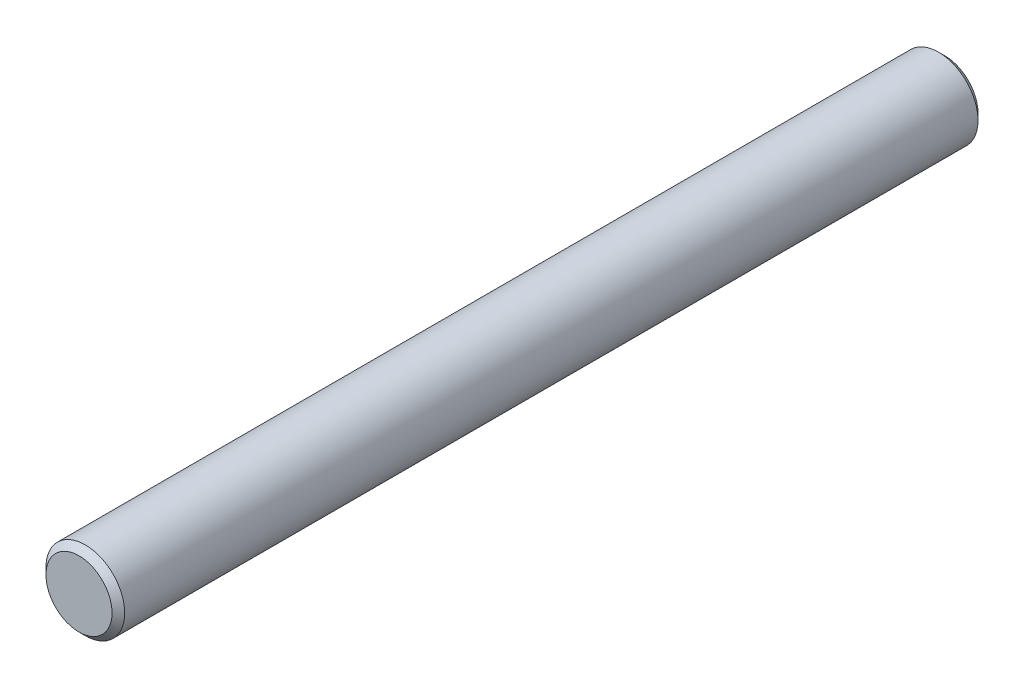
ISO-10303-21;
HEADER;
FILE_DESCRIPTION(('STEP AP214'),'2;1');
FILE_NAME('part.step','',(''),(''),'','','');
FILE_SCHEMA(('AUTOMOTIVE_DESIGN { 1 0 10303 214 1 1 1 1 }'));
ENDSEC;
DATA;
#1=APPLICATION_CONTEXT('core data for automotive mechanical design processes');
#2=APPLICATION_PROTOCOL_DEFINITION('international standard','automotive_design',2000,#1);
#3=PRODUCT_CONTEXT('',#1,'mechanical');
#4=PRODUCT('Part','Part','',(#3));
#5=PRODUCT_RELATED_PRODUCT_CATEGORY('part','',(#4));
#6=PRODUCT_DEFINITION_FORMATION('','',#4);
#7=PRODUCT_DEFINITION_CONTEXT('part definition',#1,'design');
#8=PRODUCT_DEFINITION('design','',#6,#7);
#9=PRODUCT_DEFINITION_SHAPE('','',#8);
#10=(LENGTH_UNIT() NAMED_UNIT(*) SI_UNIT(.MILLI.,.METRE.));
#11=(NAMED_UNIT(*) PLANE_ANGLE_UNIT() SI_UNIT($,.RADIAN.));
#12=(NAMED_UNIT(*) SI_UNIT($,.STERADIAN.) SOLID_ANGLE_UNIT());
#13=UNCERTAINTY_MEASURE_WITH_UNIT(LENGTH_MEASURE(1.E-05),#10,'distance_accuracy_value','');
#14=(GEOMETRIC_REPRESENTATION_CONTEXT(3) GLOBAL_UNCERTAINTY_ASSIGNED_CONTEXT((#13)) GLOBAL_UNIT_ASSIGNED_CONTEXT((#10,
#11,#12)) REPRESENTATION_CONTEXT('',''));
#15=CARTESIAN_POINT('',(0.,0.,0.));
#16=DIRECTION('',(0.,0.,1.));
#17=DIRECTION('',(1.,0.,0.));
#18=AXIS2_PLACEMENT_3D('',#15,#16,#17);
#19=CARTESIAN_POINT('',(0.,0.,13.75));
#20=DIRECTION('',(0.,0.,-1.));
#21=DIRECTION('',(-1.,0.,0.));
#22=AXIS2_PLACEMENT_3D('',#19,#20,#21);
#23=CYLINDRICAL_SURFACE('',#22,1.25);
#24=CARTESIAN_POINT('',(0.,0.,-13.55));
#25=DIRECTION('',(0.,0.,1.));
#26=DIRECTION('',(1.,0.,0.));
#27=AXIS2_PLACEMENT_3D('',#24,#25,#26);
#28=CIRCLE('',#27,1.25);
#29=CARTESIAN_POINT('',(1.25,0.,-13.55));
#30=VERTEX_POINT('',#29);
#31=EDGE_CURVE('E50',#30,#30,#28,.T.);
#32=ORIENTED_EDGE('',*,*,#31,.T.);
#33=EDGE_LOOP('',(#32));
#34=FACE_BOUND('',#33,.T.);
#35=CARTESIAN_POINT('',(0.,0.,13.55));
#36=DIRECTION('',(0.,0.,1.));
#37=DIRECTION('',(1.,0.,0.));
#38=AXIS2_PLACEMENT_3D('',#35,#36,#37);
#39=CIRCLE('',#38,1.25);
#40=CARTESIAN_POINT('',(1.25,0.,13.55));
#41=VERTEX_POINT('',#40);
#42=EDGE_CURVE('E55',#41,#41,#39,.F.);
#43=ORIENTED_EDGE('',*,*,#42,.T.);
#44=EDGE_LOOP('',(#43));
#45=FACE_BOUND('',#44,.T.);
#46=ADVANCED_FACE('F37',(#34,#45),#23,.T.);
#47=CARTESIAN_POINT('',(0.,0.,13.75));
#48=DIRECTION('',(0.,0.,1.));
#49=DIRECTION('',(1.,0.,0.));
#50=AXIS2_PLACEMENT_3D('',#47,#48,#49);
#51=PLANE('',#50);
#52=CARTESIAN_POINT('',(0.,0.,13.75));
#53=DIRECTION('',(0.,0.,1.));
#54=DIRECTION('',(1.,0.,0.));
#55=AXIS2_PLACEMENT_3D('',#52,#53,#54);
#56=CIRCLE('',#55,1.05);
#57=CARTESIAN_POINT('',(1.05,0.,13.75));
#58=VERTEX_POINT('',#57);
#59=EDGE_CURVE('E10',#58,#58,#56,.T.);
#60=ORIENTED_EDGE('',*,*,#59,.T.);
#61=EDGE_LOOP('',(#60));
#62=FACE_BOUND('',#61,.T.);
#63=ADVANCED_FACE('F72',(#62),#51,.T.);
#64=CARTESIAN_POINT('',(0.,0.,-13.75));
#65=DIRECTION('',(0.,0.,1.));
#66=DIRECTION('',(1.,0.,0.));
#67=AXIS2_PLACEMENT_3D('',#64,#65,#66);
#68=PLANE('',#67);
#69=CARTESIAN_POINT('',(0.,0.,-13.75));
#70=DIRECTION('',(0.,0.,1.));
#71=DIRECTION('',(1.,0.,0.));
#72=AXIS2_PLACEMENT_3D('',#69,#70,#71);
#73=CIRCLE('',#72,1.05000000000001);
#74=CARTESIAN_POINT('',(1.05000000000001,0.,-13.75));
#75=VERTEX_POINT('',#74);
#76=EDGE_CURVE('E45',#75,#75,#73,.F.);
#77=ORIENTED_EDGE('',*,*,#76,.T.);
#78=EDGE_LOOP('',(#77));
#79=FACE_BOUND('',#78,.T.);
#80=ADVANCED_FACE('F69',(#79),#68,.F.);
#81=CARTESIAN_POINT('',(0.,0.,-13.55));
#82=DIRECTION('',(0.,0.,1.));
#83=DIRECTION('',(1.,0.,0.));
#84=AXIS2_PLACEMENT_3D('',#81,#82,#83);
#85=CONICAL_SURFACE('',#84,1.25,0.785398163397436);
#86=ORIENTED_EDGE('',*,*,#76,.F.);
#87=EDGE_LOOP('',(#86));
#88=FACE_BOUND('',#87,.T.);
#89=ORIENTED_EDGE('',*,*,#31,.F.);
#90=EDGE_LOOP('',(#89));
#91=FACE_BOUND('',#90,.T.);
#92=ADVANCED_FACE('F65',(#88,#91),#85,.T.);
#93=CARTESIAN_POINT('',(0.,0.,13.75));
#94=DIRECTION('',(0.,0.,-1.));
#95=DIRECTION('',(-1.,0.,0.));
#96=AXIS2_PLACEMENT_3D('',#93,#94,#95);
#97=CONICAL_SURFACE('',#96,1.05,0.785398163397445);
#98=ORIENTED_EDGE('',*,*,#42,.F.);
#99=EDGE_LOOP('',(#98));
#100=FACE_BOUND('',#99,.T.);
#101=ORIENTED_EDGE('',*,*,#59,.F.);
#102=EDGE_LOOP('',(#101));
#103=FACE_BOUND('',#102,.T.);
#104=ADVANCED_FACE('F39',(#100,#103),#97,.T.);
#105=CLOSED_SHELL('',(#46,#63,#80,#92,#104));
#106=MANIFOLD_SOLID_BREP('B2',#105);
#107=ADVANCED_BREP_SHAPE_REPRESENTATION('',(#18,#106),#14);
#108=SHAPE_DEFINITION_REPRESENTATION(#9,#107);
ENDSEC;
END-ISO-10303-21;
